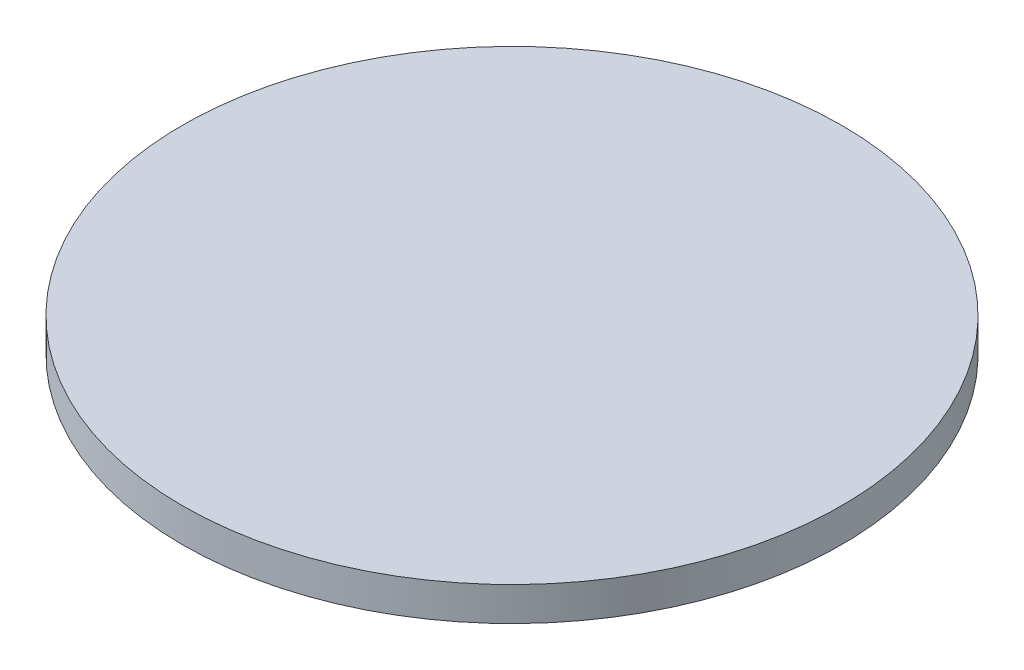
ISO-10303-21;
HEADER;
FILE_DESCRIPTION(('STEP AP214'),'2;1');
FILE_NAME('part.step','',(''),(''),'','','');
FILE_SCHEMA(('AUTOMOTIVE_DESIGN { 1 0 10303 214 1 1 1 1 }'));
ENDSEC;
DATA;
#1=APPLICATION_CONTEXT('core data for automotive mechanical design processes');
#2=APPLICATION_PROTOCOL_DEFINITION('international standard','automotive_design',2000,#1);
#3=PRODUCT_CONTEXT('',#1,'mechanical');
#4=PRODUCT('Part','Part','',(#3));
#5=PRODUCT_RELATED_PRODUCT_CATEGORY('part','',(#4));
#6=PRODUCT_DEFINITION_FORMATION('','',#4);
#7=PRODUCT_DEFINITION_CONTEXT('part definition',#1,'design');
#8=PRODUCT_DEFINITION('design','',#6,#7);
#9=PRODUCT_DEFINITION_SHAPE('','',#8);
#10=(LENGTH_UNIT() NAMED_UNIT(*) SI_UNIT(.MILLI.,.METRE.));
#11=(NAMED_UNIT(*) PLANE_ANGLE_UNIT() SI_UNIT($,.RADIAN.));
#12=(NAMED_UNIT(*) SI_UNIT($,.STERADIAN.) SOLID_ANGLE_UNIT());
#13=UNCERTAINTY_MEASURE_WITH_UNIT(LENGTH_MEASURE(1.E-05),#10,'distance_accuracy_value','');
#14=(GEOMETRIC_REPRESENTATION_CONTEXT(3) GLOBAL_UNCERTAINTY_ASSIGNED_CONTEXT((#13)) GLOBAL_UNIT_ASSIGNED_CONTEXT((#10,
#11,#12)) REPRESENTATION_CONTEXT('',''));
#15=CARTESIAN_POINT('',(0.,0.,0.));
#16=DIRECTION('',(0.,0.,1.));
#17=DIRECTION('',(1.,0.,0.));
#18=AXIS2_PLACEMENT_3D('',#15,#16,#17);
#19=CARTESIAN_POINT('',(0.,2.,0.));
#20=DIRECTION('',(0.,-1.,0.));
#21=DIRECTION('',(0.,0.,-1.));
#22=AXIS2_PLACEMENT_3D('',#19,#20,#21);
#23=CYLINDRICAL_SURFACE('',#22,19.5);
#24=CARTESIAN_POINT('',(0.,2.,0.));
#25=DIRECTION('',(0.,1.,0.));
#26=DIRECTION('',(0.,0.,1.));
#27=AXIS2_PLACEMENT_3D('',#24,#25,#26);
#28=CIRCLE('',#27,19.5);
#29=CARTESIAN_POINT('',(0.,2.,19.5));
#30=VERTEX_POINT('',#29);
#31=EDGE_CURVE('E10',#30,#30,#28,.T.);
#32=ORIENTED_EDGE('',*,*,#31,.F.);
#33=EDGE_LOOP('',(#32));
#34=FACE_BOUND('',#33,.T.);
#35=CARTESIAN_POINT('',(0.,0.,0.));
#36=DIRECTION('',(0.,1.,0.));
#37=DIRECTION('',(0.,0.,1.));
#38=AXIS2_PLACEMENT_3D('',#35,#36,#37);
#39=CIRCLE('',#38,19.5);
#40=CARTESIAN_POINT('',(0.,0.,19.5));
#41=VERTEX_POINT('',#40);
#42=EDGE_CURVE('E40',#41,#41,#39,.T.);
#43=ORIENTED_EDGE('',*,*,#42,.T.);
#44=EDGE_LOOP('',(#43));
#45=FACE_BOUND('',#44,.T.);
#46=ADVANCED_FACE('F37',(#34,#45),#23,.T.);
#47=CARTESIAN_POINT('',(0.,2.,0.));
#48=DIRECTION('',(0.,1.,0.));
#49=DIRECTION('',(0.,0.,1.));
#50=AXIS2_PLACEMENT_3D('',#47,#48,#49);
#51=PLANE('',#50);
#52=ORIENTED_EDGE('',*,*,#31,.T.);
#53=EDGE_LOOP('',(#52));
#54=FACE_BOUND('',#53,.T.);
#55=ADVANCED_FACE('F54',(#54),#51,.T.);
#56=CARTESIAN_POINT('',(0.,0.,0.));
#57=DIRECTION('',(0.,1.,0.));
#58=DIRECTION('',(0.,0.,1.));
#59=AXIS2_PLACEMENT_3D('',#56,#57,#58);
#60=PLANE('',#59);
#61=ORIENTED_EDGE('',*,*,#42,.F.);
#62=EDGE_LOOP('',(#61));
#63=FACE_BOUND('',#62,.T.);
#64=ADVANCED_FACE('F52',(#63),#60,.F.);
#65=CLOSED_SHELL('',(#46,#55,#64));
#66=MANIFOLD_SOLID_BREP('B2',#65);
#67=ADVANCED_BREP_SHAPE_REPRESENTATION('',(#18,#66),#14);
#68=SHAPE_DEFINITION_REPRESENTATION(#9,#67);
ENDSEC;
END-ISO-10303-21;
